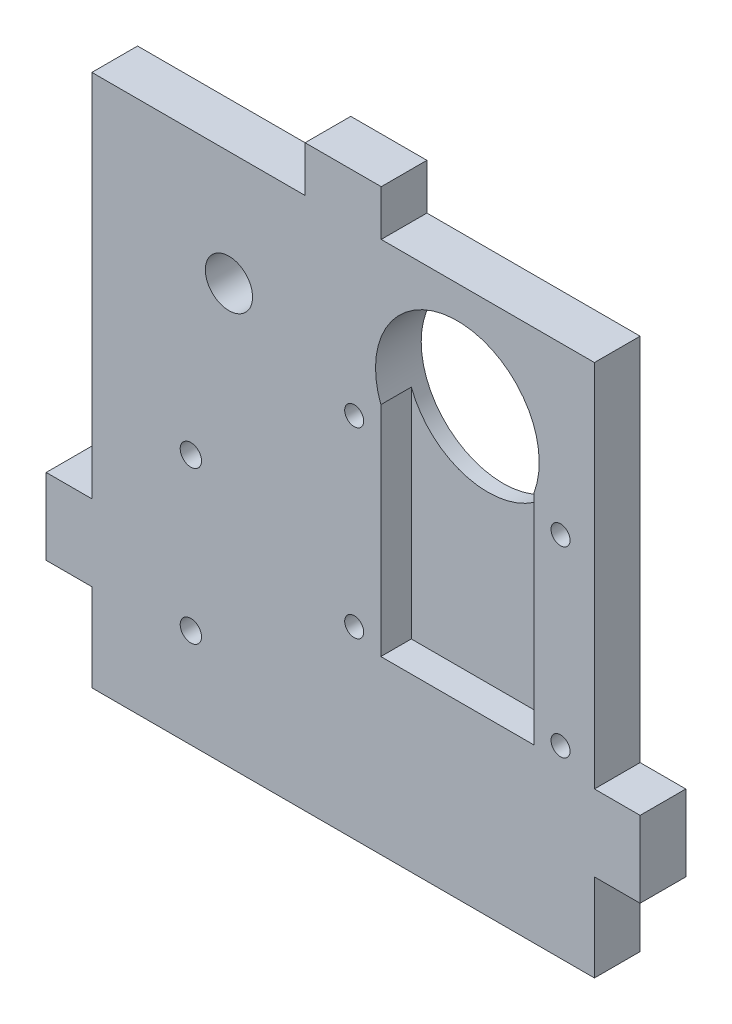
ISO-10303-21;
HEADER;
FILE_DESCRIPTION(('STEP AP214'),'2;1');
FILE_NAME('part.step','',(''),(''),'','','');
FILE_SCHEMA(('AUTOMOTIVE_DESIGN { 1 0 10303 214 1 1 1 1 }'));
ENDSEC;
DATA;
#1=APPLICATION_CONTEXT('core data for automotive mechanical design processes');
#2=APPLICATION_PROTOCOL_DEFINITION('international standard','automotive_design',2000,#1);
#3=PRODUCT_CONTEXT('',#1,'mechanical');
#4=PRODUCT('Part','Part','',(#3));
#5=PRODUCT_RELATED_PRODUCT_CATEGORY('part','',(#4));
#6=PRODUCT_DEFINITION_FORMATION('','',#4);
#7=PRODUCT_DEFINITION_CONTEXT('part definition',#1,'design');
#8=PRODUCT_DEFINITION('design','',#6,#7);
#9=PRODUCT_DEFINITION_SHAPE('','',#8);
#10=(LENGTH_UNIT() NAMED_UNIT(*) SI_UNIT(.MILLI.,.METRE.));
#11=(NAMED_UNIT(*) PLANE_ANGLE_UNIT() SI_UNIT($,.RADIAN.));
#12=(NAMED_UNIT(*) SI_UNIT($,.STERADIAN.) SOLID_ANGLE_UNIT());
#13=UNCERTAINTY_MEASURE_WITH_UNIT(LENGTH_MEASURE(1.E-05),#10,'distance_accuracy_value','');
#14=(GEOMETRIC_REPRESENTATION_CONTEXT(3) GLOBAL_UNCERTAINTY_ASSIGNED_CONTEXT((#13)) GLOBAL_UNIT_ASSIGNED_CONTEXT((#10,
#11,#12)) REPRESENTATION_CONTEXT('',''));
#15=CARTESIAN_POINT('',(0.,0.,0.));
#16=DIRECTION('',(0.,0.,1.));
#17=DIRECTION('',(1.,0.,0.));
#18=AXIS2_PLACEMENT_3D('',#15,#16,#17);
#19=CARTESIAN_POINT('',(33.,0.,6.));
#20=DIRECTION('',(1.,0.,0.));
#21=DIRECTION('',(0.,0.,-1.));
#22=AXIS2_PLACEMENT_3D('',#19,#20,#21);
#23=PLANE('',#22);
#24=DIRECTION('',(0.,-1.,0.));
#25=VECTOR('',#24,1.);
#26=CARTESIAN_POINT('',(33.,0.,0.));
#27=LINE('',#26,#25);
#28=CARTESIAN_POINT('',(33.,-43.5,0.));
#29=VERTEX_POINT('',#28);
#30=CARTESIAN_POINT('',(33.,-55.,0.));
#31=VERTEX_POINT('',#30);
#32=EDGE_CURVE('E272',#29,#31,#27,.T.);
#33=ORIENTED_EDGE('',*,*,#32,.F.);
#34=DIRECTION('',(0.,0.,1.));
#35=VECTOR('',#34,1.);
#36=CARTESIAN_POINT('',(33.,-43.5,0.));
#37=LINE('',#36,#35);
#38=CARTESIAN_POINT('',(33.,-43.5,6.));
#39=VERTEX_POINT('',#38);
#40=EDGE_CURVE('E222',#29,#39,#37,.T.);
#41=ORIENTED_EDGE('',*,*,#40,.T.);
#42=DIRECTION('',(0.,-1.,0.));
#43=VECTOR('',#42,1.);
#44=CARTESIAN_POINT('',(33.,0.,6.));
#45=LINE('',#44,#43);
#46=CARTESIAN_POINT('',(33.,-55.,6.));
#47=VERTEX_POINT('',#46);
#48=EDGE_CURVE('E453',#39,#47,#45,.T.);
#49=ORIENTED_EDGE('',*,*,#48,.T.);
#50=DIRECTION('',(0.,0.,-1.));
#51=VECTOR('',#50,1.);
#52=CARTESIAN_POINT('',(33.,-55.,6.));
#53=LINE('',#52,#51);
#54=EDGE_CURVE('E290',#47,#31,#53,.T.);
#55=ORIENTED_EDGE('',*,*,#54,.T.);
#56=EDGE_LOOP('',(#33,#41,#49,#55));
#57=FACE_BOUND('',#56,.T.);
#58=ADVANCED_FACE('F34',(#57),#23,.T.);
#59=CARTESIAN_POINT('',(-33.,0.,6.));
#60=DIRECTION('',(1.,0.,0.));
#61=DIRECTION('',(0.,1.,0.));
#62=AXIS2_PLACEMENT_3D('',#59,#60,#61);
#63=PLANE('',#62);
#64=DIRECTION('',(0.,0.,1.));
#65=VECTOR('',#64,1.);
#66=CARTESIAN_POINT('',(-33.,-43.5,0.));
#67=LINE('',#66,#65);
#68=CARTESIAN_POINT('',(-33.,-43.5,0.));
#69=VERTEX_POINT('',#68);
#70=CARTESIAN_POINT('',(-33.,-43.5,6.));
#71=VERTEX_POINT('',#70);
#72=EDGE_CURVE('E253',#69,#71,#67,.T.);
#73=ORIENTED_EDGE('',*,*,#72,.F.);
#74=DIRECTION('',(0.,-1.,0.));
#75=VECTOR('',#74,1.);
#76=CARTESIAN_POINT('',(-33.,0.,0.));
#77=LINE('',#76,#75);
#78=CARTESIAN_POINT('',(-33.,-55.,0.));
#79=VERTEX_POINT('',#78);
#80=EDGE_CURVE('E300',#69,#79,#77,.T.);
#81=ORIENTED_EDGE('',*,*,#80,.T.);
#82=DIRECTION('',(0.,0.,-1.));
#83=VECTOR('',#82,1.);
#84=CARTESIAN_POINT('',(-33.,-55.,6.));
#85=LINE('',#84,#83);
#86=CARTESIAN_POINT('',(-33.,-55.,6.));
#87=VERTEX_POINT('',#86);
#88=EDGE_CURVE('E43',#87,#79,#85,.T.);
#89=ORIENTED_EDGE('',*,*,#88,.F.);
#90=DIRECTION('',(0.,-1.,0.));
#91=VECTOR('',#90,1.);
#92=CARTESIAN_POINT('',(-33.,0.,6.));
#93=LINE('',#92,#91);
#94=EDGE_CURVE('E350',#71,#87,#93,.T.);
#95=ORIENTED_EDGE('',*,*,#94,.F.);
#96=EDGE_LOOP('',(#73,#81,#89,#95));
#97=FACE_BOUND('',#96,.T.);
#98=ADVANCED_FACE('F423',(#97),#63,.F.);
#99=CARTESIAN_POINT('',(0.,15.,6.));
#100=DIRECTION('',(0.,-1.,0.));
#101=DIRECTION('',(1.,0.,0.));
#102=AXIS2_PLACEMENT_3D('',#99,#100,#101);
#103=PLANE('',#102);
#104=DIRECTION('',(0.,0.,1.));
#105=VECTOR('',#104,1.);
#106=CARTESIAN_POINT('',(-5.,15.,0.));
#107=LINE('',#106,#105);
#108=CARTESIAN_POINT('',(-5.,15.,0.));
#109=VERTEX_POINT('',#108);
#110=CARTESIAN_POINT('',(-5.,15.,6.));
#111=VERTEX_POINT('',#110);
#112=EDGE_CURVE('E327',#109,#111,#107,.T.);
#113=ORIENTED_EDGE('',*,*,#112,.F.);
#114=DIRECTION('',(-1.,0.,0.));
#115=VECTOR('',#114,1.);
#116=CARTESIAN_POINT('',(0.,15.,0.));
#117=LINE('',#116,#115);
#118=CARTESIAN_POINT('',(-33.,15.,0.));
#119=VERTEX_POINT('',#118);
#120=EDGE_CURVE('E301',#109,#119,#117,.T.);
#121=ORIENTED_EDGE('',*,*,#120,.T.);
#122=DIRECTION('',(0.,0.,-1.));
#123=VECTOR('',#122,1.);
#124=CARTESIAN_POINT('',(-33.,15.,6.));
#125=LINE('',#124,#123);
#126=CARTESIAN_POINT('',(-33.,15.,6.));
#127=VERTEX_POINT('',#126);
#128=EDGE_CURVE('E11',#127,#119,#125,.T.);
#129=ORIENTED_EDGE('',*,*,#128,.F.);
#130=DIRECTION('',(-1.,0.,0.));
#131=VECTOR('',#130,1.);
#132=CARTESIAN_POINT('',(0.,15.,6.));
#133=LINE('',#132,#131);
#134=EDGE_CURVE('E340',#111,#127,#133,.T.);
#135=ORIENTED_EDGE('',*,*,#134,.F.);
#136=EDGE_LOOP('',(#113,#121,#129,#135));
#137=FACE_BOUND('',#136,.T.);
#138=ADVANCED_FACE('F370',(#137),#103,.F.);
#139=CARTESIAN_POINT('',(33.,15.,0.));
#140=VERTEX_POINT('',#139);
#141=CARTESIAN_POINT('',(5.,15.,0.));
#142=VERTEX_POINT('',#141);
#143=EDGE_CURVE('E296',#140,#142,#117,.T.);
#144=ORIENTED_EDGE('',*,*,#143,.T.);
#145=DIRECTION('',(0.,0.,1.));
#146=VECTOR('',#145,1.);
#147=CARTESIAN_POINT('',(5.,15.,0.));
#148=LINE('',#147,#146);
#149=CARTESIAN_POINT('',(5.,15.,6.));
#150=VERTEX_POINT('',#149);
#151=EDGE_CURVE('E330',#142,#150,#148,.T.);
#152=ORIENTED_EDGE('',*,*,#151,.T.);
#153=CARTESIAN_POINT('',(33.,15.,6.));
#154=VERTEX_POINT('',#153);
#155=EDGE_CURVE('E348',#154,#150,#133,.T.);
#156=ORIENTED_EDGE('',*,*,#155,.F.);
#157=DIRECTION('',(0.,0.,-1.));
#158=VECTOR('',#157,1.);
#159=CARTESIAN_POINT('',(33.,15.,6.));
#160=LINE('',#159,#158);
#161=EDGE_CURVE('E288',#154,#140,#160,.T.);
#162=ORIENTED_EDGE('',*,*,#161,.T.);
#163=EDGE_LOOP('',(#144,#152,#156,#162));
#164=FACE_BOUND('',#163,.T.);
#165=ADVANCED_FACE('F451',(#164),#103,.F.);
#166=CARTESIAN_POINT('',(-33.,-33.5,0.));
#167=VERTEX_POINT('',#166);
#168=EDGE_CURVE('E313',#119,#167,#77,.T.);
#169=ORIENTED_EDGE('',*,*,#168,.T.);
#170=DIRECTION('',(0.,0.,1.));
#171=VECTOR('',#170,1.);
#172=CARTESIAN_POINT('',(-33.,-33.5,0.));
#173=LINE('',#172,#171);
#174=CARTESIAN_POINT('',(-33.,-33.5,6.));
#175=VERTEX_POINT('',#174);
#176=EDGE_CURVE('E260',#167,#175,#173,.T.);
#177=ORIENTED_EDGE('',*,*,#176,.T.);
#178=EDGE_CURVE('E353',#127,#175,#93,.T.);
#179=ORIENTED_EDGE('',*,*,#178,.F.);
#180=ORIENTED_EDGE('',*,*,#128,.T.);
#181=EDGE_LOOP('',(#169,#177,#179,#180));
#182=FACE_BOUND('',#181,.T.);
#183=ADVANCED_FACE('F368',(#182),#63,.F.);
#184=CARTESIAN_POINT('',(0.,-55.,6.));
#185=DIRECTION('',(0.,1.,0.));
#186=DIRECTION('',(-1.,0.,0.));
#187=AXIS2_PLACEMENT_3D('',#184,#185,#186);
#188=PLANE('',#187);
#189=DIRECTION('',(1.,0.,0.));
#190=VECTOR('',#189,1.);
#191=CARTESIAN_POINT('',(0.,-55.,0.));
#192=LINE('',#191,#190);
#193=EDGE_CURVE('E277',#79,#31,#192,.T.);
#194=ORIENTED_EDGE('',*,*,#193,.T.);
#195=ORIENTED_EDGE('',*,*,#54,.F.);
#196=DIRECTION('',(1.,0.,0.));
#197=VECTOR('',#196,1.);
#198=CARTESIAN_POINT('',(0.,-55.,6.));
#199=LINE('',#198,#197);
#200=EDGE_CURVE('E369',#87,#47,#199,.T.);
#201=ORIENTED_EDGE('',*,*,#200,.F.);
#202=ORIENTED_EDGE('',*,*,#88,.T.);
#203=EDGE_LOOP('',(#194,#195,#201,#202));
#204=FACE_BOUND('',#203,.T.);
#205=ADVANCED_FACE('F478',(#204),#188,.F.);
#206=CARTESIAN_POINT('',(-15.,0.,6.));
#207=DIRECTION('',(0.,0.,-1.));
#208=DIRECTION('',(-1.,0.,0.));
#209=AXIS2_PLACEMENT_3D('',#206,#207,#208);
#210=CYLINDRICAL_SURFACE('',#209,3.1);
#211=CARTESIAN_POINT('',(-15.,0.,6.));
#212=DIRECTION('',(0.,0.,1.));
#213=DIRECTION('',(1.,0.,0.));
#214=AXIS2_PLACEMENT_3D('',#211,#212,#213);
#215=CIRCLE('',#214,3.1);
#216=CARTESIAN_POINT('',(-11.9,0.,6.));
#217=VERTEX_POINT('',#216);
#218=EDGE_CURVE('E455',#217,#217,#215,.T.);
#219=ORIENTED_EDGE('',*,*,#218,.T.);
#220=EDGE_LOOP('',(#219));
#221=FACE_BOUND('',#220,.T.);
#222=CARTESIAN_POINT('',(-15.,0.,0.));
#223=DIRECTION('',(0.,0.,1.));
#224=DIRECTION('',(1.,0.,0.));
#225=AXIS2_PLACEMENT_3D('',#222,#223,#224);
#226=CIRCLE('',#225,3.1);
#227=CARTESIAN_POINT('',(-11.9,0.,0.));
#228=VERTEX_POINT('',#227);
#229=EDGE_CURVE('E282',#228,#228,#226,.T.);
#230=ORIENTED_EDGE('',*,*,#229,.F.);
#231=EDGE_LOOP('',(#230));
#232=FACE_BOUND('',#231,.T.);
#233=ADVANCED_FACE('F443',(#221,#232),#210,.F.);
#234=CARTESIAN_POINT('',(-20.,-42.,6.));
#235=DIRECTION('',(0.,0.,-1.));
#236=DIRECTION('',(-1.,0.,0.));
#237=AXIS2_PLACEMENT_3D('',#234,#235,#236);
#238=CYLINDRICAL_SURFACE('',#237,1.4);
#239=CARTESIAN_POINT('',(-20.,-42.,6.));
#240=DIRECTION('',(0.,0.,1.));
#241=DIRECTION('',(1.,0.,0.));
#242=AXIS2_PLACEMENT_3D('',#239,#240,#241);
#243=CIRCLE('',#242,1.4);
#244=CARTESIAN_POINT('',(-18.6,-42.,6.));
#245=VERTEX_POINT('',#244);
#246=EDGE_CURVE('E452',#245,#245,#243,.F.);
#247=ORIENTED_EDGE('',*,*,#246,.F.);
#248=EDGE_LOOP('',(#247));
#249=FACE_BOUND('',#248,.T.);
#250=CARTESIAN_POINT('',(-20.,-42.,0.));
#251=DIRECTION('',(0.,0.,1.));
#252=DIRECTION('',(1.,0.,0.));
#253=AXIS2_PLACEMENT_3D('',#250,#251,#252);
#254=CIRCLE('',#253,1.4);
#255=CARTESIAN_POINT('',(-18.6,-42.,0.));
#256=VERTEX_POINT('',#255);
#257=EDGE_CURVE('E271',#256,#256,#254,.F.);
#258=ORIENTED_EDGE('',*,*,#257,.T.);
#259=EDGE_LOOP('',(#258));
#260=FACE_BOUND('',#259,.T.);
#261=ADVANCED_FACE('F436',(#249,#260),#238,.F.);
#262=DIRECTION('',(0.,0.,1.));
#263=VECTOR('',#262,1.);
#264=CARTESIAN_POINT('',(33.,-33.5,0.));
#265=LINE('',#264,#263);
#266=CARTESIAN_POINT('',(33.,-33.5,0.));
#267=VERTEX_POINT('',#266);
#268=CARTESIAN_POINT('',(33.,-33.5,6.));
#269=VERTEX_POINT('',#268);
#270=EDGE_CURVE('E215',#267,#269,#265,.T.);
#271=ORIENTED_EDGE('',*,*,#270,.F.);
#272=EDGE_CURVE('E267',#140,#267,#27,.T.);
#273=ORIENTED_EDGE('',*,*,#272,.F.);
#274=ORIENTED_EDGE('',*,*,#161,.F.);
#275=EDGE_CURVE('E447',#154,#269,#45,.T.);
#276=ORIENTED_EDGE('',*,*,#275,.T.);
#277=EDGE_LOOP('',(#271,#273,#274,#276));
#278=FACE_BOUND('',#277,.T.);
#279=ADVANCED_FACE('F426',(#278),#23,.T.);
#280=CARTESIAN_POINT('',(15.,0.,6.));
#281=DIRECTION('',(0.,0.,-1.));
#282=DIRECTION('',(-1.,0.,0.));
#283=AXIS2_PLACEMENT_3D('',#280,#281,#282);
#284=CYLINDRICAL_SURFACE('',#283,10.75);
#285=CARTESIAN_POINT('',(15.,0.,2.));
#286=DIRECTION('',(0.,0.,-1.));
#287=DIRECTION('',(1.,0.,0.));
#288=AXIS2_PLACEMENT_3D('',#285,#286,#287);
#289=CIRCLE('',#288,10.75);
#290=CARTESIAN_POINT('',(25.05,-3.81575680566778,2.));
#291=VERTEX_POINT('',#290);
#292=CARTESIAN_POINT('',(4.95,-3.81575680566778,2.));
#293=VERTEX_POINT('',#292);
#294=EDGE_CURVE('E180',#291,#293,#289,.T.);
#295=ORIENTED_EDGE('',*,*,#294,.F.);
#296=DIRECTION('',(0.,0.,1.));
#297=VECTOR('',#296,1.);
#298=CARTESIAN_POINT('',(25.05,-3.81575680566778,2.));
#299=LINE('',#298,#297);
#300=CARTESIAN_POINT('',(25.05,-3.81575680566778,6.));
#301=VERTEX_POINT('',#300);
#302=EDGE_CURVE('E751',#291,#301,#299,.T.);
#303=ORIENTED_EDGE('',*,*,#302,.T.);
#304=CARTESIAN_POINT('',(15.,0.,6.));
#305=DIRECTION('',(0.,0.,1.));
#306=DIRECTION('',(1.,0.,0.));
#307=AXIS2_PLACEMENT_3D('',#304,#305,#306);
#308=CIRCLE('',#307,10.75);
#309=CARTESIAN_POINT('',(4.95,-3.81575680566778,6.));
#310=VERTEX_POINT('',#309);
#311=EDGE_CURVE('E194',#310,#301,#308,.F.);
#312=ORIENTED_EDGE('',*,*,#311,.F.);
#313=DIRECTION('',(0.,0.,1.));
#314=VECTOR('',#313,1.);
#315=CARTESIAN_POINT('',(4.95,-3.81575680566778,2.));
#316=LINE('',#315,#314);
#317=EDGE_CURVE('E51',#293,#310,#316,.T.);
#318=ORIENTED_EDGE('',*,*,#317,.F.);
#319=EDGE_LOOP('',(#295,#303,#312,#318));
#320=FACE_BOUND('',#319,.T.);
#321=CARTESIAN_POINT('',(15.,0.,0.));
#322=DIRECTION('',(0.,0.,1.));
#323=DIRECTION('',(1.,0.,0.));
#324=AXIS2_PLACEMENT_3D('',#321,#322,#323);
#325=CIRCLE('',#324,10.75);
#326=CARTESIAN_POINT('',(25.75,0.,0.));
#327=VERTEX_POINT('',#326);
#328=EDGE_CURVE('E305',#327,#327,#325,.F.);
#329=ORIENTED_EDGE('',*,*,#328,.T.);
#330=EDGE_LOOP('',(#329));
#331=FACE_BOUND('',#330,.T.);
#332=ADVANCED_FACE('F36',(#320,#331),#284,.F.);
#333=CARTESIAN_POINT('',(-20.,-22.,6.));
#334=DIRECTION('',(0.,0.,-1.));
#335=DIRECTION('',(-1.,0.,0.));
#336=AXIS2_PLACEMENT_3D('',#333,#334,#335);
#337=CYLINDRICAL_SURFACE('',#336,1.4);
#338=CARTESIAN_POINT('',(-20.,-22.,6.));
#339=DIRECTION('',(0.,0.,1.));
#340=DIRECTION('',(1.,0.,0.));
#341=AXIS2_PLACEMENT_3D('',#338,#339,#340);
#342=CIRCLE('',#341,1.4);
#343=CARTESIAN_POINT('',(-18.6,-22.,6.));
#344=VERTEX_POINT('',#343);
#345=EDGE_CURVE('E291',#344,#344,#342,.F.);
#346=ORIENTED_EDGE('',*,*,#345,.F.);
#347=EDGE_LOOP('',(#346));
#348=FACE_BOUND('',#347,.T.);
#349=CARTESIAN_POINT('',(-20.,-22.,0.));
#350=DIRECTION('',(0.,0.,1.));
#351=DIRECTION('',(1.,0.,0.));
#352=AXIS2_PLACEMENT_3D('',#349,#350,#351);
#353=CIRCLE('',#352,1.4);
#354=CARTESIAN_POINT('',(-18.6,-22.,0.));
#355=VERTEX_POINT('',#354);
#356=EDGE_CURVE('E285',#355,#355,#353,.F.);
#357=ORIENTED_EDGE('',*,*,#356,.T.);
#358=EDGE_LOOP('',(#357));
#359=FACE_BOUND('',#358,.T.);
#360=ADVANCED_FACE('F442',(#348,#359),#337,.F.);
#361=CARTESIAN_POINT('',(0.,0.,6.));
#362=DIRECTION('',(0.,0.,1.));
#363=DIRECTION('',(1.,0.,0.));
#364=AXIS2_PLACEMENT_3D('',#361,#362,#363);
#365=PLANE('',#364);
#366=CARTESIAN_POINT('',(1.45,-6.81575680566778,6.));
#367=DIRECTION('',(0.,0.,1.));
#368=DIRECTION('',(1.,0.,0.));
#369=AXIS2_PLACEMENT_3D('',#366,#367,#368);
#370=CIRCLE('',#369,1.25);
#371=CARTESIAN_POINT('',(2.7,-6.81575680566778,6.));
#372=VERTEX_POINT('',#371);
#373=EDGE_CURVE('E722',#372,#372,#370,.T.);
#374=ORIENTED_EDGE('',*,*,#373,.F.);
#375=EDGE_LOOP('',(#374));
#376=FACE_BOUND('',#375,.T.);
#377=CARTESIAN_POINT('',(1.45,-30.8157568056678,6.));
#378=DIRECTION('',(0.,0.,1.));
#379=DIRECTION('',(1.,0.,0.));
#380=AXIS2_PLACEMENT_3D('',#377,#378,#379);
#381=CIRCLE('',#380,1.25);
#382=CARTESIAN_POINT('',(2.7,-30.8157568056678,6.));
#383=VERTEX_POINT('',#382);
#384=EDGE_CURVE('E724',#383,#383,#381,.T.);
#385=ORIENTED_EDGE('',*,*,#384,.F.);
#386=EDGE_LOOP('',(#385));
#387=FACE_BOUND('',#386,.T.);
#388=CARTESIAN_POINT('',(28.55,-30.8157568056678,6.));
#389=DIRECTION('',(0.,0.,1.));
#390=DIRECTION('',(1.,0.,0.));
#391=AXIS2_PLACEMENT_3D('',#388,#389,#390);
#392=CIRCLE('',#391,1.25);
#393=CARTESIAN_POINT('',(29.8,-30.8157568056678,6.));
#394=VERTEX_POINT('',#393);
#395=EDGE_CURVE('E730',#394,#394,#392,.T.);
#396=ORIENTED_EDGE('',*,*,#395,.F.);
#397=EDGE_LOOP('',(#396));
#398=FACE_BOUND('',#397,.T.);
#399=CARTESIAN_POINT('',(28.55,-6.81575680566778,6.));
#400=DIRECTION('',(0.,0.,1.));
#401=DIRECTION('',(1.,0.,0.));
#402=AXIS2_PLACEMENT_3D('',#399,#400,#401);
#403=CIRCLE('',#402,1.25);
#404=CARTESIAN_POINT('',(29.8,-6.81575680566778,6.));
#405=VERTEX_POINT('',#404);
#406=EDGE_CURVE('E736',#405,#405,#403,.T.);
#407=ORIENTED_EDGE('',*,*,#406,.F.);
#408=EDGE_LOOP('',(#407));
#409=FACE_BOUND('',#408,.T.);
#410=DIRECTION('',(0.,1.,0.));
#411=VECTOR('',#410,1.);
#412=CARTESIAN_POINT('',(25.05,-32.4657568056678,6.));
#413=LINE('',#412,#411);
#414=CARTESIAN_POINT('',(25.05,-32.4657568056678,6.));
#415=VERTEX_POINT('',#414);
#416=EDGE_CURVE('E189',#415,#301,#413,.T.);
#417=ORIENTED_EDGE('',*,*,#416,.F.);
#418=DIRECTION('',(1.,0.,0.));
#419=VECTOR('',#418,1.);
#420=CARTESIAN_POINT('',(4.95,-32.4657568056678,6.));
#421=LINE('',#420,#419);
#422=CARTESIAN_POINT('',(4.95,-32.4657568056678,6.));
#423=VERTEX_POINT('',#422);
#424=EDGE_CURVE('E747',#423,#415,#421,.T.);
#425=ORIENTED_EDGE('',*,*,#424,.F.);
#426=DIRECTION('',(0.,-1.,0.));
#427=VECTOR('',#426,1.);
#428=CARTESIAN_POINT('',(4.95,-3.81575680566778,6.));
#429=LINE('',#428,#427);
#430=EDGE_CURVE('E742',#310,#423,#429,.T.);
#431=ORIENTED_EDGE('',*,*,#430,.F.);
#432=ORIENTED_EDGE('',*,*,#311,.T.);
#433=EDGE_LOOP('',(#417,#425,#431,#432));
#434=FACE_BOUND('',#433,.T.);
#435=ORIENTED_EDGE('',*,*,#155,.T.);
#436=DIRECTION('',(0.,1.,0.));
#437=VECTOR('',#436,1.);
#438=CARTESIAN_POINT('',(5.,15.,6.));
#439=LINE('',#438,#437);
#440=CARTESIAN_POINT('',(5.,21.,6.));
#441=VERTEX_POINT('',#440);
#442=EDGE_CURVE('E320',#150,#441,#439,.T.);
#443=ORIENTED_EDGE('',*,*,#442,.T.);
#444=DIRECTION('',(-1.,0.,0.));
#445=VECTOR('',#444,1.);
#446=CARTESIAN_POINT('',(-5.,21.,6.));
#447=LINE('',#446,#445);
#448=CARTESIAN_POINT('',(-5.,21.,6.));
#449=VERTEX_POINT('',#448);
#450=EDGE_CURVE('E326',#441,#449,#447,.T.);
#451=ORIENTED_EDGE('',*,*,#450,.T.);
#452=DIRECTION('',(0.,-1.,0.));
#453=VECTOR('',#452,1.);
#454=CARTESIAN_POINT('',(-5.,15.,6.));
#455=LINE('',#454,#453);
#456=EDGE_CURVE('E256',#449,#111,#455,.T.);
#457=ORIENTED_EDGE('',*,*,#456,.T.);
#458=ORIENTED_EDGE('',*,*,#134,.T.);
#459=ORIENTED_EDGE('',*,*,#178,.T.);
#460=DIRECTION('',(-1.,0.,0.));
#461=VECTOR('',#460,1.);
#462=CARTESIAN_POINT('',(-33.,-33.5,6.));
#463=LINE('',#462,#461);
#464=CARTESIAN_POINT('',(-39.,-33.5,6.));
#465=VERTEX_POINT('',#464);
#466=EDGE_CURVE('E218',#175,#465,#463,.T.);
#467=ORIENTED_EDGE('',*,*,#466,.T.);
#468=DIRECTION('',(0.,-1.,0.));
#469=VECTOR('',#468,1.);
#470=CARTESIAN_POINT('',(-39.,-33.5,6.));
#471=LINE('',#470,#469);
#472=CARTESIAN_POINT('',(-39.,-43.5,6.));
#473=VERTEX_POINT('',#472);
#474=EDGE_CURVE('E244',#465,#473,#471,.T.);
#475=ORIENTED_EDGE('',*,*,#474,.T.);
#476=DIRECTION('',(1.,0.,0.));
#477=VECTOR('',#476,1.);
#478=CARTESIAN_POINT('',(-33.,-43.5,6.));
#479=LINE('',#478,#477);
#480=EDGE_CURVE('E247',#473,#71,#479,.T.);
#481=ORIENTED_EDGE('',*,*,#480,.T.);
#482=ORIENTED_EDGE('',*,*,#94,.T.);
#483=ORIENTED_EDGE('',*,*,#200,.T.);
#484=ORIENTED_EDGE('',*,*,#48,.F.);
#485=DIRECTION('',(1.,0.,0.));
#486=VECTOR('',#485,1.);
#487=CARTESIAN_POINT('',(33.,-43.5,6.));
#488=LINE('',#487,#486);
#489=CARTESIAN_POINT('',(39.,-43.5,6.));
#490=VERTEX_POINT('',#489);
#491=EDGE_CURVE('E59',#39,#490,#488,.T.);
#492=ORIENTED_EDGE('',*,*,#491,.T.);
#493=DIRECTION('',(0.,1.,0.));
#494=VECTOR('',#493,1.);
#495=CARTESIAN_POINT('',(39.,-33.5,6.));
#496=LINE('',#495,#494);
#497=CARTESIAN_POINT('',(39.,-33.5,6.));
#498=VERTEX_POINT('',#497);
#499=EDGE_CURVE('E206',#490,#498,#496,.T.);
#500=ORIENTED_EDGE('',*,*,#499,.T.);
#501=DIRECTION('',(-1.,0.,0.));
#502=VECTOR('',#501,1.);
#503=CARTESIAN_POINT('',(33.,-33.5,6.));
#504=LINE('',#503,#502);
#505=EDGE_CURVE('E209',#498,#269,#504,.T.);
#506=ORIENTED_EDGE('',*,*,#505,.T.);
#507=ORIENTED_EDGE('',*,*,#275,.F.);
#508=EDGE_LOOP('',(#435,#443,#451,#457,#458,#459,#467,#475,#481,#482,#483,#484,#492,#500,#506,#507));
#509=FACE_BOUND('',#508,.T.);
#510=ORIENTED_EDGE('',*,*,#246,.T.);
#511=EDGE_LOOP('',(#510));
#512=FACE_BOUND('',#511,.T.);
#513=ORIENTED_EDGE('',*,*,#218,.F.);
#514=EDGE_LOOP('',(#513));
#515=FACE_BOUND('',#514,.T.);
#516=ORIENTED_EDGE('',*,*,#345,.T.);
#517=EDGE_LOOP('',(#516));
#518=FACE_BOUND('',#517,.T.);
#519=ADVANCED_FACE('F358',(#376,#387,#398,#409,#434,#509,#512,#515,#518),#365,.T.);
#520=CARTESIAN_POINT('',(0.,0.,0.));
#521=DIRECTION('',(0.,0.,1.));
#522=DIRECTION('',(1.,0.,0.));
#523=AXIS2_PLACEMENT_3D('',#520,#521,#522);
#524=PLANE('',#523);
#525=CARTESIAN_POINT('',(1.45,-6.81575680566778,0.));
#526=DIRECTION('',(0.,0.,1.));
#527=DIRECTION('',(1.,0.,0.));
#528=AXIS2_PLACEMENT_3D('',#525,#526,#527);
#529=CIRCLE('',#528,1.25);
#530=CARTESIAN_POINT('',(2.7,-6.81575680566778,0.));
#531=VERTEX_POINT('',#530);
#532=EDGE_CURVE('E719',#531,#531,#529,.T.);
#533=ORIENTED_EDGE('',*,*,#532,.T.);
#534=EDGE_LOOP('',(#533));
#535=FACE_BOUND('',#534,.T.);
#536=CARTESIAN_POINT('',(1.45,-30.8157568056678,0.));
#537=DIRECTION('',(0.,0.,1.));
#538=DIRECTION('',(1.,0.,0.));
#539=AXIS2_PLACEMENT_3D('',#536,#537,#538);
#540=CIRCLE('',#539,1.25);
#541=CARTESIAN_POINT('',(2.7,-30.8157568056678,0.));
#542=VERTEX_POINT('',#541);
#543=EDGE_CURVE('E727',#542,#542,#540,.T.);
#544=ORIENTED_EDGE('',*,*,#543,.T.);
#545=EDGE_LOOP('',(#544));
#546=FACE_BOUND('',#545,.T.);
#547=CARTESIAN_POINT('',(28.55,-30.8157568056678,0.));
#548=DIRECTION('',(0.,0.,1.));
#549=DIRECTION('',(1.,0.,0.));
#550=AXIS2_PLACEMENT_3D('',#547,#548,#549);
#551=CIRCLE('',#550,1.25);
#552=CARTESIAN_POINT('',(29.8,-30.8157568056678,0.));
#553=VERTEX_POINT('',#552);
#554=EDGE_CURVE('E733',#553,#553,#551,.T.);
#555=ORIENTED_EDGE('',*,*,#554,.T.);
#556=EDGE_LOOP('',(#555));
#557=FACE_BOUND('',#556,.T.);
#558=CARTESIAN_POINT('',(28.55,-6.81575680566778,0.));
#559=DIRECTION('',(0.,0.,1.));
#560=DIRECTION('',(1.,0.,0.));
#561=AXIS2_PLACEMENT_3D('',#558,#559,#560);
#562=CIRCLE('',#561,1.25);
#563=CARTESIAN_POINT('',(29.8,-6.81575680566778,0.));
#564=VERTEX_POINT('',#563);
#565=EDGE_CURVE('E739',#564,#564,#562,.T.);
#566=ORIENTED_EDGE('',*,*,#565,.T.);
#567=EDGE_LOOP('',(#566));
#568=FACE_BOUND('',#567,.T.);
#569=ORIENTED_EDGE('',*,*,#328,.F.);
#570=EDGE_LOOP('',(#569));
#571=FACE_BOUND('',#570,.T.);
#572=ORIENTED_EDGE('',*,*,#143,.F.);
#573=ORIENTED_EDGE('',*,*,#272,.T.);
#574=DIRECTION('',(-1.,0.,0.));
#575=VECTOR('',#574,1.);
#576=CARTESIAN_POINT('',(33.,-33.5,0.));
#577=LINE('',#576,#575);
#578=CARTESIAN_POINT('',(39.,-33.5,0.));
#579=VERTEX_POINT('',#578);
#580=EDGE_CURVE('E204',#579,#267,#577,.T.);
#581=ORIENTED_EDGE('',*,*,#580,.F.);
#582=DIRECTION('',(0.,1.,0.));
#583=VECTOR('',#582,1.);
#584=CARTESIAN_POINT('',(39.,-33.5,0.));
#585=LINE('',#584,#583);
#586=CARTESIAN_POINT('',(39.,-43.5,0.));
#587=VERTEX_POINT('',#586);
#588=EDGE_CURVE('E201',#587,#579,#585,.T.);
#589=ORIENTED_EDGE('',*,*,#588,.F.);
#590=DIRECTION('',(1.,0.,0.));
#591=VECTOR('',#590,1.);
#592=CARTESIAN_POINT('',(33.,-43.5,0.));
#593=LINE('',#592,#591);
#594=EDGE_CURVE('E205',#29,#587,#593,.T.);
#595=ORIENTED_EDGE('',*,*,#594,.F.);
#596=ORIENTED_EDGE('',*,*,#32,.T.);
#597=ORIENTED_EDGE('',*,*,#193,.F.);
#598=ORIENTED_EDGE('',*,*,#80,.F.);
#599=DIRECTION('',(1.,0.,0.));
#600=VECTOR('',#599,1.);
#601=CARTESIAN_POINT('',(-33.,-43.5,0.));
#602=LINE('',#601,#600);
#603=CARTESIAN_POINT('',(-39.,-43.5,0.));
#604=VERTEX_POINT('',#603);
#605=EDGE_CURVE('E242',#604,#69,#602,.T.);
#606=ORIENTED_EDGE('',*,*,#605,.F.);
#607=DIRECTION('',(0.,-1.,0.));
#608=VECTOR('',#607,1.);
#609=CARTESIAN_POINT('',(-39.,-33.5,0.));
#610=LINE('',#609,#608);
#611=CARTESIAN_POINT('',(-39.,-33.5,0.));
#612=VERTEX_POINT('',#611);
#613=EDGE_CURVE('E239',#612,#604,#610,.T.);
#614=ORIENTED_EDGE('',*,*,#613,.F.);
#615=DIRECTION('',(-1.,0.,0.));
#616=VECTOR('',#615,1.);
#617=CARTESIAN_POINT('',(-33.,-33.5,0.));
#618=LINE('',#617,#616);
#619=EDGE_CURVE('E243',#167,#612,#618,.T.);
#620=ORIENTED_EDGE('',*,*,#619,.F.);
#621=ORIENTED_EDGE('',*,*,#168,.F.);
#622=ORIENTED_EDGE('',*,*,#120,.F.);
#623=DIRECTION('',(0.,-1.,0.));
#624=VECTOR('',#623,1.);
#625=CARTESIAN_POINT('',(-5.,15.,0.));
#626=LINE('',#625,#624);
#627=CARTESIAN_POINT('',(-5.,21.,0.));
#628=VERTEX_POINT('',#627);
#629=EDGE_CURVE('E323',#628,#109,#626,.T.);
#630=ORIENTED_EDGE('',*,*,#629,.F.);
#631=DIRECTION('',(-1.,0.,0.));
#632=VECTOR('',#631,1.);
#633=CARTESIAN_POINT('',(-5.,21.,0.));
#634=LINE('',#633,#632);
#635=CARTESIAN_POINT('',(5.,21.,0.));
#636=VERTEX_POINT('',#635);
#637=EDGE_CURVE('E331',#636,#628,#634,.T.);
#638=ORIENTED_EDGE('',*,*,#637,.F.);
#639=DIRECTION('',(0.,1.,0.));
#640=VECTOR('',#639,1.);
#641=CARTESIAN_POINT('',(5.,15.,0.));
#642=LINE('',#641,#640);
#643=EDGE_CURVE('E325',#142,#636,#642,.T.);
#644=ORIENTED_EDGE('',*,*,#643,.F.);
#645=EDGE_LOOP('',(#572,#573,#581,#589,#595,#596,#597,#598,#606,#614,#620,#621,#622,#630,#638,#644));
#646=FACE_BOUND('',#645,.T.);
#647=ORIENTED_EDGE('',*,*,#257,.F.);
#648=EDGE_LOOP('',(#647));
#649=FACE_BOUND('',#648,.T.);
#650=ORIENTED_EDGE('',*,*,#229,.T.);
#651=EDGE_LOOP('',(#650));
#652=FACE_BOUND('',#651,.T.);
#653=ORIENTED_EDGE('',*,*,#356,.F.);
#654=EDGE_LOOP('',(#653));
#655=FACE_BOUND('',#654,.T.);
#656=ADVANCED_FACE('F377',(#535,#546,#557,#568,#571,#646,#649,#652,#655),#524,.F.);
#657=CARTESIAN_POINT('',(-5.,15.,0.));
#658=DIRECTION('',(-1.,0.,0.));
#659=DIRECTION('',(0.,-1.,0.));
#660=AXIS2_PLACEMENT_3D('',#657,#658,#659);
#661=PLANE('',#660);
#662=ORIENTED_EDGE('',*,*,#456,.F.);
#663=DIRECTION('',(0.,0.,1.));
#664=VECTOR('',#663,1.);
#665=CARTESIAN_POINT('',(-5.,21.,0.));
#666=LINE('',#665,#664);
#667=EDGE_CURVE('E394',#628,#449,#666,.T.);
#668=ORIENTED_EDGE('',*,*,#667,.F.);
#669=ORIENTED_EDGE('',*,*,#629,.T.);
#670=ORIENTED_EDGE('',*,*,#112,.T.);
#671=EDGE_LOOP('',(#662,#668,#669,#670));
#672=FACE_BOUND('',#671,.T.);
#673=ADVANCED_FACE('F410',(#672),#661,.T.);
#674=CARTESIAN_POINT('',(-5.,21.,0.));
#675=DIRECTION('',(0.,1.,0.));
#676=DIRECTION('',(0.,0.,1.));
#677=AXIS2_PLACEMENT_3D('',#674,#675,#676);
#678=PLANE('',#677);
#679=ORIENTED_EDGE('',*,*,#450,.F.);
#680=DIRECTION('',(0.,0.,1.));
#681=VECTOR('',#680,1.);
#682=CARTESIAN_POINT('',(5.,21.,0.));
#683=LINE('',#682,#681);
#684=EDGE_CURVE('E395',#636,#441,#683,.T.);
#685=ORIENTED_EDGE('',*,*,#684,.F.);
#686=ORIENTED_EDGE('',*,*,#637,.T.);
#687=ORIENTED_EDGE('',*,*,#667,.T.);
#688=EDGE_LOOP('',(#679,#685,#686,#687));
#689=FACE_BOUND('',#688,.T.);
#690=ADVANCED_FACE('F408',(#689),#678,.T.);
#691=CARTESIAN_POINT('',(5.,15.,0.));
#692=DIRECTION('',(1.,0.,0.));
#693=DIRECTION('',(0.,0.,-1.));
#694=AXIS2_PLACEMENT_3D('',#691,#692,#693);
#695=PLANE('',#694);
#696=ORIENTED_EDGE('',*,*,#442,.F.);
#697=ORIENTED_EDGE('',*,*,#151,.F.);
#698=ORIENTED_EDGE('',*,*,#643,.T.);
#699=ORIENTED_EDGE('',*,*,#684,.T.);
#700=EDGE_LOOP('',(#696,#697,#698,#699));
#701=FACE_BOUND('',#700,.T.);
#702=ADVANCED_FACE('F405',(#701),#695,.T.);
#703=CARTESIAN_POINT('',(-33.,-43.5,0.));
#704=DIRECTION('',(0.,-1.,0.));
#705=DIRECTION('',(1.,0.,0.));
#706=AXIS2_PLACEMENT_3D('',#703,#704,#705);
#707=PLANE('',#706);
#708=ORIENTED_EDGE('',*,*,#480,.F.);
#709=DIRECTION('',(0.,0.,1.));
#710=VECTOR('',#709,1.);
#711=CARTESIAN_POINT('',(-39.,-43.5,0.));
#712=LINE('',#711,#710);
#713=EDGE_CURVE('E250',#604,#473,#712,.T.);
#714=ORIENTED_EDGE('',*,*,#713,.F.);
#715=ORIENTED_EDGE('',*,*,#605,.T.);
#716=ORIENTED_EDGE('',*,*,#72,.T.);
#717=EDGE_LOOP('',(#708,#714,#715,#716));
#718=FACE_BOUND('',#717,.T.);
#719=ADVANCED_FACE('F562',(#718),#707,.T.);
#720=CARTESIAN_POINT('',(-39.,-33.5,0.));
#721=DIRECTION('',(-1.,0.,0.));
#722=DIRECTION('',(0.,0.,1.));
#723=AXIS2_PLACEMENT_3D('',#720,#721,#722);
#724=PLANE('',#723);
#725=ORIENTED_EDGE('',*,*,#474,.F.);
#726=DIRECTION('',(0.,0.,1.));
#727=VECTOR('',#726,1.);
#728=CARTESIAN_POINT('',(-39.,-33.5,0.));
#729=LINE('',#728,#727);
#730=EDGE_CURVE('E386',#612,#465,#729,.T.);
#731=ORIENTED_EDGE('',*,*,#730,.F.);
#732=ORIENTED_EDGE('',*,*,#613,.T.);
#733=ORIENTED_EDGE('',*,*,#713,.T.);
#734=EDGE_LOOP('',(#725,#731,#732,#733));
#735=FACE_BOUND('',#734,.T.);
#736=ADVANCED_FACE('F570',(#735),#724,.T.);
#737=CARTESIAN_POINT('',(-33.,-33.5,0.));
#738=DIRECTION('',(0.,1.,0.));
#739=DIRECTION('',(0.,0.,1.));
#740=AXIS2_PLACEMENT_3D('',#737,#738,#739);
#741=PLANE('',#740);
#742=ORIENTED_EDGE('',*,*,#466,.F.);
#743=ORIENTED_EDGE('',*,*,#176,.F.);
#744=ORIENTED_EDGE('',*,*,#619,.T.);
#745=ORIENTED_EDGE('',*,*,#730,.T.);
#746=EDGE_LOOP('',(#742,#743,#744,#745));
#747=FACE_BOUND('',#746,.T.);
#748=ADVANCED_FACE('F580',(#747),#741,.T.);
#749=CARTESIAN_POINT('',(33.,-33.5,0.));
#750=DIRECTION('',(0.,1.,0.));
#751=DIRECTION('',(0.,0.,1.));
#752=AXIS2_PLACEMENT_3D('',#749,#750,#751);
#753=PLANE('',#752);
#754=ORIENTED_EDGE('',*,*,#505,.F.);
#755=DIRECTION('',(0.,0.,1.));
#756=VECTOR('',#755,1.);
#757=CARTESIAN_POINT('',(39.,-33.5,0.));
#758=LINE('',#757,#756);
#759=EDGE_CURVE('E212',#579,#498,#758,.T.);
#760=ORIENTED_EDGE('',*,*,#759,.F.);
#761=ORIENTED_EDGE('',*,*,#580,.T.);
#762=ORIENTED_EDGE('',*,*,#270,.T.);
#763=EDGE_LOOP('',(#754,#760,#761,#762));
#764=FACE_BOUND('',#763,.T.);
#765=ADVANCED_FACE('F590',(#764),#753,.T.);
#766=CARTESIAN_POINT('',(39.,-33.5,0.));
#767=DIRECTION('',(1.,0.,0.));
#768=DIRECTION('',(0.,0.,-1.));
#769=AXIS2_PLACEMENT_3D('',#766,#767,#768);
#770=PLANE('',#769);
#771=ORIENTED_EDGE('',*,*,#499,.F.);
#772=DIRECTION('',(0.,0.,1.));
#773=VECTOR('',#772,1.);
#774=CARTESIAN_POINT('',(39.,-43.5,0.));
#775=LINE('',#774,#773);
#776=EDGE_CURVE('E234',#587,#490,#775,.T.);
#777=ORIENTED_EDGE('',*,*,#776,.F.);
#778=ORIENTED_EDGE('',*,*,#588,.T.);
#779=ORIENTED_EDGE('',*,*,#759,.T.);
#780=EDGE_LOOP('',(#771,#777,#778,#779));
#781=FACE_BOUND('',#780,.T.);
#782=ADVANCED_FACE('F599',(#781),#770,.T.);
#783=CARTESIAN_POINT('',(33.,-43.5,0.));
#784=DIRECTION('',(0.,-1.,0.));
#785=DIRECTION('',(0.,0.,-1.));
#786=AXIS2_PLACEMENT_3D('',#783,#784,#785);
#787=PLANE('',#786);
#788=ORIENTED_EDGE('',*,*,#491,.F.);
#789=ORIENTED_EDGE('',*,*,#40,.F.);
#790=ORIENTED_EDGE('',*,*,#594,.T.);
#791=ORIENTED_EDGE('',*,*,#776,.T.);
#792=EDGE_LOOP('',(#788,#789,#790,#791));
#793=FACE_BOUND('',#792,.T.);
#794=ADVANCED_FACE('F608',(#793),#787,.T.);
#795=CARTESIAN_POINT('',(25.05,-32.4657568056678,2.));
#796=DIRECTION('',(1.,0.,0.));
#797=DIRECTION('',(0.,1.,0.));
#798=AXIS2_PLACEMENT_3D('',#795,#796,#797);
#799=PLANE('',#798);
#800=ORIENTED_EDGE('',*,*,#416,.T.);
#801=ORIENTED_EDGE('',*,*,#302,.F.);
#802=DIRECTION('',(0.,1.,0.));
#803=VECTOR('',#802,1.);
#804=CARTESIAN_POINT('',(25.05,-32.4657568056678,2.));
#805=LINE('',#804,#803);
#806=CARTESIAN_POINT('',(25.05,-32.4657568056678,2.));
#807=VERTEX_POINT('',#806);
#808=EDGE_CURVE('E186',#807,#291,#805,.T.);
#809=ORIENTED_EDGE('',*,*,#808,.F.);
#810=DIRECTION('',(0.,0.,1.));
#811=VECTOR('',#810,1.);
#812=CARTESIAN_POINT('',(25.05,-32.4657568056678,2.));
#813=LINE('',#812,#811);
#814=EDGE_CURVE('E196',#807,#415,#813,.T.);
#815=ORIENTED_EDGE('',*,*,#814,.T.);
#816=EDGE_LOOP('',(#800,#801,#809,#815));
#817=FACE_BOUND('',#816,.T.);
#818=ADVANCED_FACE('F618',(#817),#799,.F.);
#819=CARTESIAN_POINT('',(4.95,-32.4657568056678,2.));
#820=DIRECTION('',(0.,-1.,0.));
#821=DIRECTION('',(0.,0.,-1.));
#822=AXIS2_PLACEMENT_3D('',#819,#820,#821);
#823=PLANE('',#822);
#824=ORIENTED_EDGE('',*,*,#424,.T.);
#825=ORIENTED_EDGE('',*,*,#814,.F.);
#826=DIRECTION('',(1.,0.,0.));
#827=VECTOR('',#826,1.);
#828=CARTESIAN_POINT('',(4.95,-32.4657568056678,2.));
#829=LINE('',#828,#827);
#830=CARTESIAN_POINT('',(4.95,-32.4657568056678,2.));
#831=VERTEX_POINT('',#830);
#832=EDGE_CURVE('E179',#831,#807,#829,.T.);
#833=ORIENTED_EDGE('',*,*,#832,.F.);
#834=DIRECTION('',(0.,0.,1.));
#835=VECTOR('',#834,1.);
#836=CARTESIAN_POINT('',(4.95,-32.4657568056678,2.));
#837=LINE('',#836,#835);
#838=EDGE_CURVE('E175',#831,#423,#837,.T.);
#839=ORIENTED_EDGE('',*,*,#838,.T.);
#840=EDGE_LOOP('',(#824,#825,#833,#839));
#841=FACE_BOUND('',#840,.T.);
#842=ADVANCED_FACE('F632',(#841),#823,.F.);
#843=CARTESIAN_POINT('',(4.95,-3.81575680566778,2.));
#844=DIRECTION('',(-1.,0.,0.));
#845=DIRECTION('',(0.,-1.,0.));
#846=AXIS2_PLACEMENT_3D('',#843,#844,#845);
#847=PLANE('',#846);
#848=ORIENTED_EDGE('',*,*,#430,.T.);
#849=ORIENTED_EDGE('',*,*,#838,.F.);
#850=DIRECTION('',(0.,-1.,0.));
#851=VECTOR('',#850,1.);
#852=CARTESIAN_POINT('',(4.95,-3.81575680566778,2.));
#853=LINE('',#852,#851);
#854=EDGE_CURVE('E172',#293,#831,#853,.T.);
#855=ORIENTED_EDGE('',*,*,#854,.F.);
#856=ORIENTED_EDGE('',*,*,#317,.T.);
#857=EDGE_LOOP('',(#848,#849,#855,#856));
#858=FACE_BOUND('',#857,.T.);
#859=ADVANCED_FACE('F174',(#858),#847,.F.);
#860=CARTESIAN_POINT('',(15.,0.,2.));
#861=DIRECTION('',(0.,0.,1.));
#862=DIRECTION('',(1.,0.,0.));
#863=AXIS2_PLACEMENT_3D('',#860,#861,#862);
#864=PLANE('',#863);
#865=ORIENTED_EDGE('',*,*,#294,.T.);
#866=ORIENTED_EDGE('',*,*,#854,.T.);
#867=ORIENTED_EDGE('',*,*,#832,.T.);
#868=ORIENTED_EDGE('',*,*,#808,.T.);
#869=EDGE_LOOP('',(#865,#866,#867,#868));
#870=FACE_BOUND('',#869,.T.);
#871=ADVANCED_FACE('F184',(#870),#864,.T.);
#872=CARTESIAN_POINT('',(28.55,-6.81575680566778,0.));
#873=DIRECTION('',(0.,0.,1.));
#874=DIRECTION('',(1.,0.,0.));
#875=AXIS2_PLACEMENT_3D('',#872,#873,#874);
#876=CYLINDRICAL_SURFACE('',#875,1.25);
#877=ORIENTED_EDGE('',*,*,#565,.F.);
#878=EDGE_LOOP('',(#877));
#879=FACE_BOUND('',#878,.T.);
#880=ORIENTED_EDGE('',*,*,#406,.T.);
#881=EDGE_LOOP('',(#880));
#882=FACE_BOUND('',#881,.T.);
#883=ADVANCED_FACE('F659',(#879,#882),#876,.F.);
#884=CARTESIAN_POINT('',(28.55,-30.8157568056678,0.));
#885=DIRECTION('',(0.,0.,1.));
#886=DIRECTION('',(1.,0.,0.));
#887=AXIS2_PLACEMENT_3D('',#884,#885,#886);
#888=CYLINDRICAL_SURFACE('',#887,1.25);
#889=ORIENTED_EDGE('',*,*,#554,.F.);
#890=EDGE_LOOP('',(#889));
#891=FACE_BOUND('',#890,.T.);
#892=ORIENTED_EDGE('',*,*,#395,.T.);
#893=EDGE_LOOP('',(#892));
#894=FACE_BOUND('',#893,.T.);
#895=ADVANCED_FACE('F682',(#891,#894),#888,.F.);
#896=CARTESIAN_POINT('',(1.45,-30.8157568056678,0.));
#897=DIRECTION('',(0.,0.,1.));
#898=DIRECTION('',(1.,0.,0.));
#899=AXIS2_PLACEMENT_3D('',#896,#897,#898);
#900=CYLINDRICAL_SURFACE('',#899,1.25);
#901=ORIENTED_EDGE('',*,*,#543,.F.);
#902=EDGE_LOOP('',(#901));
#903=FACE_BOUND('',#902,.T.);
#904=ORIENTED_EDGE('',*,*,#384,.T.);
#905=EDGE_LOOP('',(#904));
#906=FACE_BOUND('',#905,.T.);
#907=ADVANCED_FACE('F692',(#903,#906),#900,.F.);
#908=CARTESIAN_POINT('',(1.45,-6.81575680566778,0.));
#909=DIRECTION('',(0.,0.,1.));
#910=DIRECTION('',(1.,0.,0.));
#911=AXIS2_PLACEMENT_3D('',#908,#909,#910);
#912=CYLINDRICAL_SURFACE('',#911,1.25);
#913=ORIENTED_EDGE('',*,*,#532,.F.);
#914=EDGE_LOOP('',(#913));
#915=FACE_BOUND('',#914,.T.);
#916=ORIENTED_EDGE('',*,*,#373,.T.);
#917=EDGE_LOOP('',(#916));
#918=FACE_BOUND('',#917,.T.);
#919=ADVANCED_FACE('F702',(#915,#918),#912,.F.);
#920=CLOSED_SHELL('',(#58,#98,#138,#165,#183,#205,#233,#261,#279,#332,#360,#519,#656,#673,#690,
#702,#719,#736,#748,#765,#782,#794,#818,#842,#859,#871,#883,#895,#907,#919));
#921=MANIFOLD_SOLID_BREP('B2',#920);
#922=ADVANCED_BREP_SHAPE_REPRESENTATION('',(#18,#921),#14);
#923=SHAPE_DEFINITION_REPRESENTATION(#9,#922);
ENDSEC;
END-ISO-10303-21;
